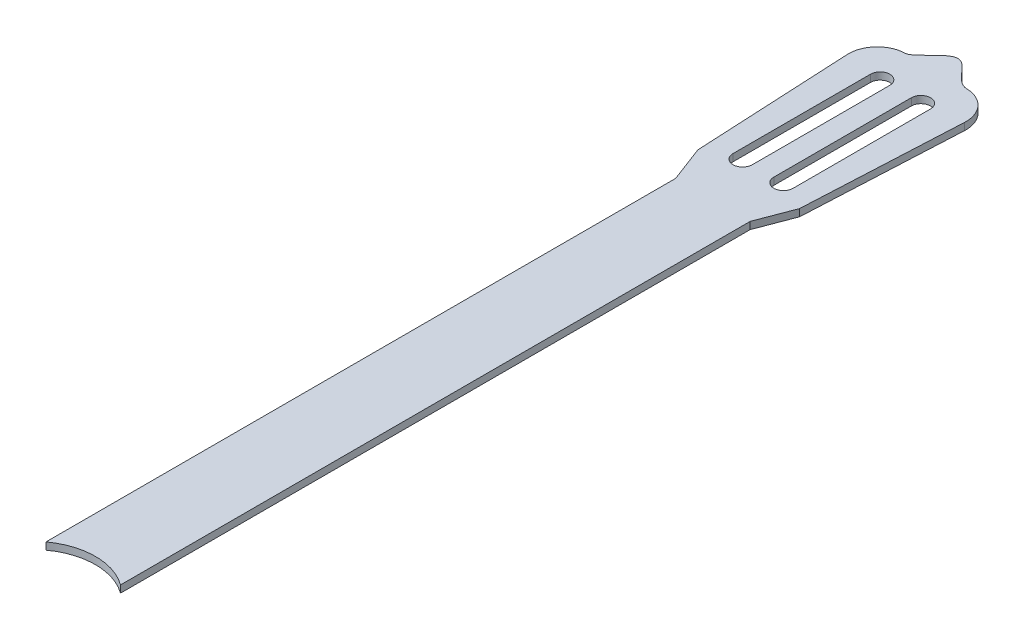
ISO-10303-21;
HEADER;
FILE_DESCRIPTION(('STEP AP214'),'2;1');
FILE_NAME('part.step','',(''),(''),'','','');
FILE_SCHEMA(('AUTOMOTIVE_DESIGN { 1 0 10303 214 1 1 1 1 }'));
ENDSEC;
DATA;
#1=APPLICATION_CONTEXT('core data for automotive mechanical design processes');
#2=APPLICATION_PROTOCOL_DEFINITION('international standard','automotive_design',2000,#1);
#3=PRODUCT_CONTEXT('',#1,'mechanical');
#4=PRODUCT('Part','Part','',(#3));
#5=PRODUCT_RELATED_PRODUCT_CATEGORY('part','',(#4));
#6=PRODUCT_DEFINITION_FORMATION('','',#4);
#7=PRODUCT_DEFINITION_CONTEXT('part definition',#1,'design');
#8=PRODUCT_DEFINITION('design','',#6,#7);
#9=PRODUCT_DEFINITION_SHAPE('','',#8);
#10=(LENGTH_UNIT() NAMED_UNIT(*) SI_UNIT(.MILLI.,.METRE.));
#11=(NAMED_UNIT(*) PLANE_ANGLE_UNIT() SI_UNIT($,.RADIAN.));
#12=(NAMED_UNIT(*) SI_UNIT($,.STERADIAN.) SOLID_ANGLE_UNIT());
#13=UNCERTAINTY_MEASURE_WITH_UNIT(LENGTH_MEASURE(1.E-05),#10,'distance_accuracy_value','');
#14=(GEOMETRIC_REPRESENTATION_CONTEXT(3) GLOBAL_UNCERTAINTY_ASSIGNED_CONTEXT((#13)) GLOBAL_UNIT_ASSIGNED_CONTEXT((#10,
#11,#12)) REPRESENTATION_CONTEXT('',''));
#15=CARTESIAN_POINT('',(0.,0.,0.));
#16=DIRECTION('',(0.,0.,1.));
#17=DIRECTION('',(1.,0.,0.));
#18=AXIS2_PLACEMENT_3D('',#15,#16,#17);
#19=CARTESIAN_POINT('',(0.,10.,-95.5));
#20=DIRECTION('',(0.,-1.,0.));
#21=DIRECTION('',(0.,0.,-1.));
#22=AXIS2_PLACEMENT_3D('',#19,#20,#21);
#23=CYLINDRICAL_SURFACE('',#22,44.);
#24=CARTESIAN_POINT('',(0.,5.,-95.5));
#25=DIRECTION('',(0.,-1.,0.));
#26=DIRECTION('',(0.,0.,1.));
#27=AXIS2_PLACEMENT_3D('',#24,#25,#26);
#28=CIRCLE('',#27,44.);
#29=CARTESIAN_POINT('',(-26.,5.,-130.996478698598));
#30=VERTEX_POINT('',#29);
#31=CARTESIAN_POINT('',(26.,5.,-130.996478698598));
#32=VERTEX_POINT('',#31);
#33=EDGE_CURVE('E283',#30,#32,#28,.T.);
#34=ORIENTED_EDGE('',*,*,#33,.T.);
#35=DIRECTION('',(0.,-1.,0.));
#36=VECTOR('',#35,1.);
#37=CARTESIAN_POINT('',(26.,10.,-130.996478698598));
#38=LINE('',#37,#36);
#39=CARTESIAN_POINT('',(26.,10.,-130.996478698598));
#40=VERTEX_POINT('',#39);
#41=EDGE_CURVE('E11',#40,#32,#38,.T.);
#42=ORIENTED_EDGE('',*,*,#41,.F.);
#43=CARTESIAN_POINT('',(0.,10.,-95.5));
#44=DIRECTION('',(0.,-1.,0.));
#45=DIRECTION('',(0.,0.,1.));
#46=AXIS2_PLACEMENT_3D('',#43,#44,#45);
#47=CIRCLE('',#46,44.);
#48=CARTESIAN_POINT('',(-26.,10.,-130.996478698598));
#49=VERTEX_POINT('',#48);
#50=EDGE_CURVE('E313',#49,#40,#47,.T.);
#51=ORIENTED_EDGE('',*,*,#50,.F.);
#52=DIRECTION('',(0.,-1.,0.));
#53=VECTOR('',#52,1.);
#54=CARTESIAN_POINT('',(-26.,10.,-130.996478698598));
#55=LINE('',#54,#53);
#56=EDGE_CURVE('E317',#49,#30,#55,.T.);
#57=ORIENTED_EDGE('',*,*,#56,.T.);
#58=EDGE_LOOP('',(#34,#42,#51,#57));
#59=FACE_BOUND('',#58,.T.);
#60=ADVANCED_FACE('F36',(#59),#23,.F.);
#61=CARTESIAN_POINT('',(26.,10.,-130.996478698598));
#62=DIRECTION('',(-1.,0.,0.));
#63=DIRECTION('',(0.,0.,1.));
#64=AXIS2_PLACEMENT_3D('',#61,#62,#63);
#65=PLANE('',#64);
#66=DIRECTION('',(0.,0.,-1.));
#67=VECTOR('',#66,1.);
#68=CARTESIAN_POINT('',(26.,5.,-130.996478698598));
#69=LINE('',#68,#67);
#70=CARTESIAN_POINT('',(26.,5.,-570.5));
#71=VERTEX_POINT('',#70);
#72=EDGE_CURVE('E320',#32,#71,#69,.T.);
#73=ORIENTED_EDGE('',*,*,#72,.T.);
#74=DIRECTION('',(0.,-1.,0.));
#75=VECTOR('',#74,1.);
#76=CARTESIAN_POINT('',(26.,10.,-570.5));
#77=LINE('',#76,#75);
#78=CARTESIAN_POINT('',(26.,10.,-570.5));
#79=VERTEX_POINT('',#78);
#80=EDGE_CURVE('E44',#79,#71,#77,.T.);
#81=ORIENTED_EDGE('',*,*,#80,.F.);
#82=DIRECTION('',(0.,0.,-1.));
#83=VECTOR('',#82,1.);
#84=CARTESIAN_POINT('',(26.,10.,-130.996478698598));
#85=LINE('',#84,#83);
#86=EDGE_CURVE('E76',#40,#79,#85,.T.);
#87=ORIENTED_EDGE('',*,*,#86,.F.);
#88=ORIENTED_EDGE('',*,*,#41,.T.);
#89=EDGE_LOOP('',(#73,#81,#87,#88));
#90=FACE_BOUND('',#89,.T.);
#91=ADVANCED_FACE('F345',(#90),#65,.F.);
#92=CARTESIAN_POINT('',(-26.,10.,-130.996478698598));
#93=DIRECTION('',(1.,0.,0.));
#94=DIRECTION('',(0.,0.,-1.));
#95=AXIS2_PLACEMENT_3D('',#92,#93,#94);
#96=PLANE('',#95);
#97=DIRECTION('',(0.,0.,1.));
#98=VECTOR('',#97,1.);
#99=CARTESIAN_POINT('',(-26.,5.,-130.996478698598));
#100=LINE('',#99,#98);
#101=CARTESIAN_POINT('',(-26.,5.,-570.5));
#102=VERTEX_POINT('',#101);
#103=EDGE_CURVE('E69',#102,#30,#100,.T.);
#104=ORIENTED_EDGE('',*,*,#103,.T.);
#105=ORIENTED_EDGE('',*,*,#56,.F.);
#106=DIRECTION('',(0.,0.,1.));
#107=VECTOR('',#106,1.);
#108=CARTESIAN_POINT('',(-26.,10.,-130.996478698598));
#109=LINE('',#108,#107);
#110=CARTESIAN_POINT('',(-26.,10.,-570.5));
#111=VERTEX_POINT('',#110);
#112=EDGE_CURVE('E52',#111,#49,#109,.T.);
#113=ORIENTED_EDGE('',*,*,#112,.F.);
#114=DIRECTION('',(0.,-1.,0.));
#115=VECTOR('',#114,1.);
#116=CARTESIAN_POINT('',(-26.,10.,-570.5));
#117=LINE('',#116,#115);
#118=EDGE_CURVE('E66',#111,#102,#117,.T.);
#119=ORIENTED_EDGE('',*,*,#118,.T.);
#120=EDGE_LOOP('',(#104,#105,#113,#119));
#121=FACE_BOUND('',#120,.T.);
#122=ADVANCED_FACE('F347',(#121),#96,.F.);
#123=CARTESIAN_POINT('',(0.,10.,-95.5));
#124=DIRECTION('',(0.,1.,0.));
#125=DIRECTION('',(0.,0.,1.));
#126=AXIS2_PLACEMENT_3D('',#123,#124,#125);
#127=PLANE('',#126);
#128=CARTESIAN_POINT('',(21.0250764201305,10.,-706.230163942517));
#129=DIRECTION('',(0.,1.,0.));
#130=DIRECTION('',(0.,0.,1.));
#131=AXIS2_PLACEMENT_3D('',#128,#129,#130);
#132=CIRCLE('',#131,20.);
#133=CARTESIAN_POINT('',(41.,10.,-705.228950689322));
#134=VERTEX_POINT('',#133);
#135=CARTESIAN_POINT('',(21.5383523088264,10.,-726.223576554227));
#136=VERTEX_POINT('',#135);
#137=EDGE_CURVE('E211',#134,#136,#132,.T.);
#138=ORIENTED_EDGE('',*,*,#137,.T.);
#139=CARTESIAN_POINT('',(21.5383523088265,10.,-726.223576554227));
#140=CARTESIAN_POINT('',(12.9027093627812,10.,-726.445272939615));
#141=CARTESIAN_POINT('',(1.57512347588201,10.,-756.595164024179));
#142=CARTESIAN_POINT('',(-16.0529563145449,10.,-726.364399012028));
#143=CARTESIAN_POINT('',(-21.5383523088262,10.,-726.223576554227));
#144=B_SPLINE_CURVE_WITH_KNOTS('',3,(#139,#140,#141,#142,#143),.UNSPECIFIED.,.F.,.F.,(4,1,4),
(0.,0.500000000000003,1.),.UNSPECIFIED.);
#145=CARTESIAN_POINT('',(-21.5383523088262,10.,-726.223576554227));
#146=VERTEX_POINT('',#145);
#147=EDGE_CURVE('E190',#136,#146,#144,.T.);
#148=ORIENTED_EDGE('',*,*,#147,.T.);
#149=CARTESIAN_POINT('',(-21.0250764201305,10.,-706.230163942517));
#150=DIRECTION('',(0.,1.,0.));
#151=DIRECTION('',(0.,0.,1.));
#152=AXIS2_PLACEMENT_3D('',#149,#150,#151);
#153=CIRCLE('',#152,20.);
#154=CARTESIAN_POINT('',(-41.,10.,-705.228950689322));
#155=VERTEX_POINT('',#154);
#156=EDGE_CURVE('E265',#146,#155,#153,.T.);
#157=ORIENTED_EDGE('',*,*,#156,.T.);
#158=DIRECTION('',(0.0500606626597283,0.,0.998746178993476));
#159=VECTOR('',#158,1.);
#160=CARTESIAN_POINT('',(-5.63728771732021,10.,0.28256063919764));
#161=LINE('',#160,#159);
#162=CARTESIAN_POINT('',(-35.5,10.,-595.5));
#163=VERTEX_POINT('',#162);
#164=EDGE_CURVE('E268',#155,#163,#161,.T.);
#165=ORIENTED_EDGE('',*,*,#164,.T.);
#166=DIRECTION('',(0.355217760623571,0.,0.93478358058835));
#167=VECTOR('',#166,1.);
#168=CARTESIAN_POINT('',(166.716183152743,10.,-63.3521495980419));
#169=LINE('',#168,#167);
#170=EDGE_CURVE('E271',#163,#111,#169,.T.);
#171=ORIENTED_EDGE('',*,*,#170,.T.);
#172=ORIENTED_EDGE('',*,*,#112,.T.);
#173=ORIENTED_EDGE('',*,*,#50,.T.);
#174=ORIENTED_EDGE('',*,*,#86,.T.);
#175=DIRECTION('',(0.355217760623571,0.,-0.93478358058835));
#176=VECTOR('',#175,1.);
#177=CARTESIAN_POINT('',(-166.716183152743,10.,-63.3521495980419));
#178=LINE('',#177,#176);
#179=CARTESIAN_POINT('',(35.5,10.,-595.5));
#180=VERTEX_POINT('',#179);
#181=EDGE_CURVE('E273',#79,#180,#178,.T.);
#182=ORIENTED_EDGE('',*,*,#181,.T.);
#183=DIRECTION('',(0.0500606626597283,0.,-0.998746178993476));
#184=VECTOR('',#183,1.);
#185=CARTESIAN_POINT('',(5.63728771732021,10.,0.28256063919764));
#186=LINE('',#185,#184);
#187=EDGE_CURVE('E276',#180,#134,#186,.T.);
#188=ORIENTED_EDGE('',*,*,#187,.T.);
#189=EDGE_LOOP('',(#138,#148,#157,#165,#171,#172,#173,#174,#182,#188));
#190=FACE_BOUND('',#189,.T.);
#191=CARTESIAN_POINT('',(14.2412020799844,10.,-605.499999999999));
#192=DIRECTION('',(0.,1.,0.));
#193=DIRECTION('',(0.,0.,1.));
#194=AXIS2_PLACEMENT_3D('',#191,#192,#193);
#195=CIRCLE('',#194,6.74120207998441);
#196=CARTESIAN_POINT('',(7.5,10.,-605.499999999999));
#197=VERTEX_POINT('',#196);
#198=CARTESIAN_POINT('',(20.9824041599688,10.,-605.499999999999));
#199=VERTEX_POINT('',#198);
#200=EDGE_CURVE('E207',#197,#199,#195,.T.);
#201=ORIENTED_EDGE('',*,*,#200,.F.);
#202=DIRECTION('',(0.,0.,1.));
#203=VECTOR('',#202,1.);
#204=CARTESIAN_POINT('',(7.49999999999999,10.,0.));
#205=LINE('',#204,#203);
#206=CARTESIAN_POINT('',(7.5,10.,-701.465458299911));
#207=VERTEX_POINT('',#206);
#208=EDGE_CURVE('E248',#207,#197,#205,.T.);
#209=ORIENTED_EDGE('',*,*,#208,.F.);
#210=CARTESIAN_POINT('',(14.2412020799844,10.,-701.465458299911));
#211=DIRECTION('',(0.,1.,0.));
#212=DIRECTION('',(0.,0.,1.));
#213=AXIS2_PLACEMENT_3D('',#210,#211,#212);
#214=CIRCLE('',#213,6.74120207998441);
#215=CARTESIAN_POINT('',(20.9824041599688,10.,-701.465458299911));
#216=VERTEX_POINT('',#215);
#217=EDGE_CURVE('E250',#216,#207,#214,.T.);
#218=ORIENTED_EDGE('',*,*,#217,.F.);
#219=DIRECTION('',(0.,0.,1.));
#220=VECTOR('',#219,1.);
#221=CARTESIAN_POINT('',(20.9824041599689,10.,0.));
#222=LINE('',#221,#220);
#223=EDGE_CURVE('E252',#216,#199,#222,.T.);
#224=ORIENTED_EDGE('',*,*,#223,.T.);
#225=EDGE_LOOP('',(#201,#209,#218,#224));
#226=FACE_BOUND('',#225,.T.);
#227=CARTESIAN_POINT('',(-14.2412020799844,10.,-605.499999999999));
#228=DIRECTION('',(0.,1.,0.));
#229=DIRECTION('',(0.,0.,1.));
#230=AXIS2_PLACEMENT_3D('',#227,#228,#229);
#231=CIRCLE('',#230,6.74120207998443);
#232=CARTESIAN_POINT('',(-20.9824041599688,10.,-605.499999999999));
#233=VERTEX_POINT('',#232);
#234=CARTESIAN_POINT('',(-7.49999999999997,10.,-605.499999999999));
#235=VERTEX_POINT('',#234);
#236=EDGE_CURVE('E255',#233,#235,#231,.T.);
#237=ORIENTED_EDGE('',*,*,#236,.F.);
#238=DIRECTION('',(0.,0.,1.));
#239=VECTOR('',#238,1.);
#240=CARTESIAN_POINT('',(-20.9824041599689,10.,0.));
#241=LINE('',#240,#239);
#242=CARTESIAN_POINT('',(-20.9824041599688,10.,-701.465458299911));
#243=VERTEX_POINT('',#242);
#244=EDGE_CURVE('E258',#243,#233,#241,.T.);
#245=ORIENTED_EDGE('',*,*,#244,.F.);
#246=CARTESIAN_POINT('',(-14.2412020799844,10.,-701.465458299911));
#247=DIRECTION('',(0.,1.,0.));
#248=DIRECTION('',(0.,0.,1.));
#249=AXIS2_PLACEMENT_3D('',#246,#247,#248);
#250=CIRCLE('',#249,6.74120207998441);
#251=CARTESIAN_POINT('',(-7.5,10.,-701.465458299911));
#252=VERTEX_POINT('',#251);
#253=EDGE_CURVE('E260',#252,#243,#250,.T.);
#254=ORIENTED_EDGE('',*,*,#253,.F.);
#255=DIRECTION('',(0.,0.,1.));
#256=VECTOR('',#255,1.);
#257=CARTESIAN_POINT('',(-7.49999999999982,10.,0.));
#258=LINE('',#257,#256);
#259=EDGE_CURVE('E262',#252,#235,#258,.T.);
#260=ORIENTED_EDGE('',*,*,#259,.T.);
#261=EDGE_LOOP('',(#237,#245,#254,#260));
#262=FACE_BOUND('',#261,.T.);
#263=ADVANCED_FACE('F340',(#190,#226,#262),#127,.T.);
#264=CARTESIAN_POINT('',(0.,5.,-95.5));
#265=DIRECTION('',(0.,1.,0.));
#266=DIRECTION('',(0.,0.,1.));
#267=AXIS2_PLACEMENT_3D('',#264,#265,#266);
#268=PLANE('',#267);
#269=CARTESIAN_POINT('',(-21.0250764201305,5.,-706.230163942517));
#270=DIRECTION('',(0.,1.,0.));
#271=DIRECTION('',(0.,0.,1.));
#272=AXIS2_PLACEMENT_3D('',#269,#270,#271);
#273=CIRCLE('',#272,20.);
#274=CARTESIAN_POINT('',(-21.5383523088262,5.,-726.223576554227));
#275=VERTEX_POINT('',#274);
#276=CARTESIAN_POINT('',(-41.,5.,-705.228950689322));
#277=VERTEX_POINT('',#276);
#278=EDGE_CURVE('E227',#275,#277,#273,.T.);
#279=ORIENTED_EDGE('',*,*,#278,.F.);
#280=DIRECTION('',(1.,0.,0.));
#281=VECTOR('',#280,1.);
#282=CARTESIAN_POINT('',(0.,5.,-726.223576554227));
#283=LINE('',#282,#281);
#284=CARTESIAN_POINT('',(21.5383523088264,5.,-726.223576554227));
#285=VERTEX_POINT('',#284);
#286=EDGE_CURVE('E179',#275,#285,#283,.T.);
#287=ORIENTED_EDGE('',*,*,#286,.T.);
#288=CARTESIAN_POINT('',(21.0250764201305,5.,-706.230163942517));
#289=DIRECTION('',(0.,1.,0.));
#290=DIRECTION('',(0.,0.,1.));
#291=AXIS2_PLACEMENT_3D('',#288,#289,#290);
#292=CIRCLE('',#291,20.);
#293=CARTESIAN_POINT('',(41.,5.,-705.228950689322));
#294=VERTEX_POINT('',#293);
#295=EDGE_CURVE('E242',#294,#285,#292,.T.);
#296=ORIENTED_EDGE('',*,*,#295,.F.);
#297=DIRECTION('',(0.0500606626597283,0.,-0.998746178993476));
#298=VECTOR('',#297,1.);
#299=CARTESIAN_POINT('',(5.63728771732021,5.,0.28256063919764));
#300=LINE('',#299,#298);
#301=CARTESIAN_POINT('',(35.5,5.,-595.5));
#302=VERTEX_POINT('',#301);
#303=EDGE_CURVE('E239',#302,#294,#300,.T.);
#304=ORIENTED_EDGE('',*,*,#303,.F.);
#305=DIRECTION('',(0.355217760623571,0.,-0.93478358058835));
#306=VECTOR('',#305,1.);
#307=CARTESIAN_POINT('',(-166.716183152743,5.,-63.3521495980419));
#308=LINE('',#307,#306);
#309=EDGE_CURVE('E236',#71,#302,#308,.T.);
#310=ORIENTED_EDGE('',*,*,#309,.F.);
#311=ORIENTED_EDGE('',*,*,#72,.F.);
#312=ORIENTED_EDGE('',*,*,#33,.F.);
#313=ORIENTED_EDGE('',*,*,#103,.F.);
#314=DIRECTION('',(0.355217760623571,0.,0.93478358058835));
#315=VECTOR('',#314,1.);
#316=CARTESIAN_POINT('',(166.716183152743,5.,-63.3521495980419));
#317=LINE('',#316,#315);
#318=CARTESIAN_POINT('',(-35.5,5.,-595.5));
#319=VERTEX_POINT('',#318);
#320=EDGE_CURVE('E233',#319,#102,#317,.T.);
#321=ORIENTED_EDGE('',*,*,#320,.F.);
#322=DIRECTION('',(0.0500606626597283,0.,0.998746178993476));
#323=VECTOR('',#322,1.);
#324=CARTESIAN_POINT('',(-5.63728771732021,5.,0.28256063919764));
#325=LINE('',#324,#323);
#326=EDGE_CURVE('E230',#277,#319,#325,.T.);
#327=ORIENTED_EDGE('',*,*,#326,.F.);
#328=EDGE_LOOP('',(#279,#287,#296,#304,#310,#311,#312,#313,#321,#327));
#329=FACE_BOUND('',#328,.T.);
#330=CARTESIAN_POINT('',(14.2412020799844,5.,-605.499999999999));
#331=DIRECTION('',(0.,1.,0.));
#332=DIRECTION('',(0.,0.,1.));
#333=AXIS2_PLACEMENT_3D('',#330,#331,#332);
#334=CIRCLE('',#333,6.74120207998441);
#335=CARTESIAN_POINT('',(7.5,5.,-605.499999999999));
#336=VERTEX_POINT('',#335);
#337=CARTESIAN_POINT('',(20.9824041599688,5.,-605.499999999999));
#338=VERTEX_POINT('',#337);
#339=EDGE_CURVE('E208',#336,#338,#334,.T.);
#340=ORIENTED_EDGE('',*,*,#339,.T.);
#341=DIRECTION('',(0.,0.,1.));
#342=VECTOR('',#341,1.);
#343=CARTESIAN_POINT('',(20.9824041599689,5.,0.));
#344=LINE('',#343,#342);
#345=CARTESIAN_POINT('',(20.9824041599688,5.,-701.465458299911));
#346=VERTEX_POINT('',#345);
#347=EDGE_CURVE('E215',#346,#338,#344,.T.);
#348=ORIENTED_EDGE('',*,*,#347,.F.);
#349=CARTESIAN_POINT('',(14.2412020799844,5.,-701.465458299911));
#350=DIRECTION('',(0.,1.,0.));
#351=DIRECTION('',(0.,0.,1.));
#352=AXIS2_PLACEMENT_3D('',#349,#350,#351);
#353=CIRCLE('',#352,6.74120207998441);
#354=CARTESIAN_POINT('',(7.5,5.,-701.465458299911));
#355=VERTEX_POINT('',#354);
#356=EDGE_CURVE('E213',#346,#355,#353,.T.);
#357=ORIENTED_EDGE('',*,*,#356,.T.);
#358=DIRECTION('',(0.,0.,1.));
#359=VECTOR('',#358,1.);
#360=CARTESIAN_POINT('',(7.49999999999999,5.,0.));
#361=LINE('',#360,#359);
#362=EDGE_CURVE('E210',#355,#336,#361,.T.);
#363=ORIENTED_EDGE('',*,*,#362,.T.);
#364=EDGE_LOOP('',(#340,#348,#357,#363));
#365=FACE_BOUND('',#364,.T.);
#366=CARTESIAN_POINT('',(-14.2412020799844,5.,-605.499999999999));
#367=DIRECTION('',(0.,1.,0.));
#368=DIRECTION('',(0.,0.,1.));
#369=AXIS2_PLACEMENT_3D('',#366,#367,#368);
#370=CIRCLE('',#369,6.74120207998443);
#371=CARTESIAN_POINT('',(-20.9824041599688,5.,-605.499999999999));
#372=VERTEX_POINT('',#371);
#373=CARTESIAN_POINT('',(-7.49999999999997,5.,-605.499999999999));
#374=VERTEX_POINT('',#373);
#375=EDGE_CURVE('E218',#372,#374,#370,.T.);
#376=ORIENTED_EDGE('',*,*,#375,.T.);
#377=DIRECTION('',(0.,0.,1.));
#378=VECTOR('',#377,1.);
#379=CARTESIAN_POINT('',(-7.49999999999982,5.,0.));
#380=LINE('',#379,#378);
#381=CARTESIAN_POINT('',(-7.5,5.,-701.465458299911));
#382=VERTEX_POINT('',#381);
#383=EDGE_CURVE('E224',#382,#374,#380,.T.);
#384=ORIENTED_EDGE('',*,*,#383,.F.);
#385=CARTESIAN_POINT('',(-14.2412020799844,5.,-701.465458299911));
#386=DIRECTION('',(0.,1.,0.));
#387=DIRECTION('',(0.,0.,1.));
#388=AXIS2_PLACEMENT_3D('',#385,#386,#387);
#389=CIRCLE('',#388,6.74120207998441);
#390=CARTESIAN_POINT('',(-20.9824041599688,5.,-701.465458299911));
#391=VERTEX_POINT('',#390);
#392=EDGE_CURVE('E222',#382,#391,#389,.T.);
#393=ORIENTED_EDGE('',*,*,#392,.T.);
#394=DIRECTION('',(0.,0.,1.));
#395=VECTOR('',#394,1.);
#396=CARTESIAN_POINT('',(-20.9824041599689,5.,0.));
#397=LINE('',#396,#395);
#398=EDGE_CURVE('E220',#391,#372,#397,.T.);
#399=ORIENTED_EDGE('',*,*,#398,.T.);
#400=EDGE_LOOP('',(#376,#384,#393,#399));
#401=FACE_BOUND('',#400,.T.);
#402=ADVANCED_FACE('F332',(#329,#365,#401),#268,.F.);
#403=CARTESIAN_POINT('',(21.0250764201305,5.,-706.230163942517));
#404=DIRECTION('',(0.,1.,0.));
#405=DIRECTION('',(0.,0.,1.));
#406=AXIS2_PLACEMENT_3D('',#403,#404,#405);
#407=CYLINDRICAL_SURFACE('',#406,20.);
#408=ORIENTED_EDGE('',*,*,#137,.F.);
#409=DIRECTION('',(0.,1.,0.));
#410=VECTOR('',#409,1.);
#411=CARTESIAN_POINT('',(41.,5.,-705.228950689322));
#412=LINE('',#411,#410);
#413=EDGE_CURVE('E284',#294,#134,#412,.T.);
#414=ORIENTED_EDGE('',*,*,#413,.F.);
#415=ORIENTED_EDGE('',*,*,#295,.T.);
#416=DIRECTION('',(0.,1.,0.));
#417=VECTOR('',#416,1.);
#418=CARTESIAN_POINT('',(21.5383523088264,5.,-726.223576554227));
#419=LINE('',#418,#417);
#420=EDGE_CURVE('E281',#285,#136,#419,.T.);
#421=ORIENTED_EDGE('',*,*,#420,.T.);
#422=EDGE_LOOP('',(#408,#414,#415,#421));
#423=FACE_BOUND('',#422,.T.);
#424=ADVANCED_FACE('F356',(#423),#407,.T.);
#425=CARTESIAN_POINT('',(5.63728771732021,5.,0.28256063919764));
#426=DIRECTION('',(0.998746178993476,0.,0.0500606626597283));
#427=DIRECTION('',(0.0500606626597283,0.,-0.998746178993476));
#428=AXIS2_PLACEMENT_3D('',#425,#426,#427);
#429=PLANE('',#428);
#430=ORIENTED_EDGE('',*,*,#187,.F.);
#431=DIRECTION('',(0.,1.,0.));
#432=VECTOR('',#431,1.);
#433=CARTESIAN_POINT('',(35.5,5.,-595.5));
#434=LINE('',#433,#432);
#435=EDGE_CURVE('E286',#302,#180,#434,.T.);
#436=ORIENTED_EDGE('',*,*,#435,.F.);
#437=ORIENTED_EDGE('',*,*,#303,.T.);
#438=ORIENTED_EDGE('',*,*,#413,.T.);
#439=EDGE_LOOP('',(#430,#436,#437,#438));
#440=FACE_BOUND('',#439,.T.);
#441=ADVANCED_FACE('F338',(#440),#429,.T.);
#442=CARTESIAN_POINT('',(-166.716183152743,5.,-63.3521495980419));
#443=DIRECTION('',(0.93478358058835,0.,0.355217760623571));
#444=DIRECTION('',(0.355217760623571,0.,-0.93478358058835));
#445=AXIS2_PLACEMENT_3D('',#442,#443,#444);
#446=PLANE('',#445);
#447=ORIENTED_EDGE('',*,*,#181,.F.);
#448=ORIENTED_EDGE('',*,*,#80,.T.);
#449=ORIENTED_EDGE('',*,*,#309,.T.);
#450=ORIENTED_EDGE('',*,*,#435,.T.);
#451=EDGE_LOOP('',(#447,#448,#449,#450));
#452=FACE_BOUND('',#451,.T.);
#453=ADVANCED_FACE('F328',(#452),#446,.T.);
#454=CARTESIAN_POINT('',(166.716183152743,5.,-63.3521495980419));
#455=DIRECTION('',(-0.93478358058835,0.,0.355217760623571));
#456=DIRECTION('',(0.355217760623571,0.,0.93478358058835));
#457=AXIS2_PLACEMENT_3D('',#454,#455,#456);
#458=PLANE('',#457);
#459=ORIENTED_EDGE('',*,*,#170,.F.);
#460=DIRECTION('',(0.,1.,0.));
#461=VECTOR('',#460,1.);
#462=CARTESIAN_POINT('',(-35.5,5.,-595.5));
#463=LINE('',#462,#461);
#464=EDGE_CURVE('E288',#319,#163,#463,.T.);
#465=ORIENTED_EDGE('',*,*,#464,.F.);
#466=ORIENTED_EDGE('',*,*,#320,.T.);
#467=ORIENTED_EDGE('',*,*,#118,.F.);
#468=EDGE_LOOP('',(#459,#465,#466,#467));
#469=FACE_BOUND('',#468,.T.);
#470=ADVANCED_FACE('F398',(#469),#458,.T.);
#471=CARTESIAN_POINT('',(-5.63728771732021,5.,0.28256063919764));
#472=DIRECTION('',(-0.998746178993476,0.,0.0500606626597283));
#473=DIRECTION('',(0.0500606626597283,0.,0.998746178993476));
#474=AXIS2_PLACEMENT_3D('',#471,#472,#473);
#475=PLANE('',#474);
#476=ORIENTED_EDGE('',*,*,#164,.F.);
#477=DIRECTION('',(0.,1.,0.));
#478=VECTOR('',#477,1.);
#479=CARTESIAN_POINT('',(-41.,5.,-705.228950689322));
#480=LINE('',#479,#478);
#481=EDGE_CURVE('E290',#277,#155,#480,.T.);
#482=ORIENTED_EDGE('',*,*,#481,.F.);
#483=ORIENTED_EDGE('',*,*,#326,.T.);
#484=ORIENTED_EDGE('',*,*,#464,.T.);
#485=EDGE_LOOP('',(#476,#482,#483,#484));
#486=FACE_BOUND('',#485,.T.);
#487=ADVANCED_FACE('F382',(#486),#475,.T.);
#488=CARTESIAN_POINT('',(-14.2412020799844,5.,-605.499999999999));
#489=DIRECTION('',(0.,1.,0.));
#490=DIRECTION('',(0.,0.,1.));
#491=AXIS2_PLACEMENT_3D('',#488,#489,#490);
#492=CYLINDRICAL_SURFACE('',#491,6.74120207998443);
#493=ORIENTED_EDGE('',*,*,#236,.T.);
#494=DIRECTION('',(0.,1.,0.));
#495=VECTOR('',#494,1.);
#496=CARTESIAN_POINT('',(-7.49999999999997,5.,-605.499999999999));
#497=LINE('',#496,#495);
#498=EDGE_CURVE('E294',#374,#235,#497,.T.);
#499=ORIENTED_EDGE('',*,*,#498,.F.);
#500=ORIENTED_EDGE('',*,*,#375,.F.);
#501=DIRECTION('',(0.,1.,0.));
#502=VECTOR('',#501,1.);
#503=CARTESIAN_POINT('',(-20.9824041599688,5.,-605.499999999999));
#504=LINE('',#503,#502);
#505=EDGE_CURVE('E301',#372,#233,#504,.T.);
#506=ORIENTED_EDGE('',*,*,#505,.T.);
#507=EDGE_LOOP('',(#493,#499,#500,#506));
#508=FACE_BOUND('',#507,.T.);
#509=ADVANCED_FACE('F378',(#508),#492,.F.);
#510=CARTESIAN_POINT('',(-7.49999999999982,5.,0.));
#511=DIRECTION('',(-1.,0.,0.));
#512=DIRECTION('',(0.,0.,1.));
#513=AXIS2_PLACEMENT_3D('',#510,#511,#512);
#514=PLANE('',#513);
#515=ORIENTED_EDGE('',*,*,#259,.F.);
#516=DIRECTION('',(0.,1.,0.));
#517=VECTOR('',#516,1.);
#518=CARTESIAN_POINT('',(-7.5,5.,-701.465458299911));
#519=LINE('',#518,#517);
#520=EDGE_CURVE('E296',#382,#252,#519,.T.);
#521=ORIENTED_EDGE('',*,*,#520,.F.);
#522=ORIENTED_EDGE('',*,*,#383,.T.);
#523=ORIENTED_EDGE('',*,*,#498,.T.);
#524=EDGE_LOOP('',(#515,#521,#522,#523));
#525=FACE_BOUND('',#524,.T.);
#526=ADVANCED_FACE('F381',(#525),#514,.T.);
#527=CARTESIAN_POINT('',(-14.2412020799844,5.,-701.465458299911));
#528=DIRECTION('',(0.,1.,0.));
#529=DIRECTION('',(0.,0.,1.));
#530=AXIS2_PLACEMENT_3D('',#527,#528,#529);
#531=CYLINDRICAL_SURFACE('',#530,6.74120207998441);
#532=ORIENTED_EDGE('',*,*,#253,.T.);
#533=DIRECTION('',(0.,1.,0.));
#534=VECTOR('',#533,1.);
#535=CARTESIAN_POINT('',(-20.9824041599688,5.,-701.465458299911));
#536=LINE('',#535,#534);
#537=EDGE_CURVE('E298',#391,#243,#536,.T.);
#538=ORIENTED_EDGE('',*,*,#537,.F.);
#539=ORIENTED_EDGE('',*,*,#392,.F.);
#540=ORIENTED_EDGE('',*,*,#520,.T.);
#541=EDGE_LOOP('',(#532,#538,#539,#540));
#542=FACE_BOUND('',#541,.T.);
#543=ADVANCED_FACE('F363',(#542),#531,.F.);
#544=CARTESIAN_POINT('',(14.2412020799844,5.,-605.499999999999));
#545=DIRECTION('',(0.,1.,0.));
#546=DIRECTION('',(0.,0.,1.));
#547=AXIS2_PLACEMENT_3D('',#544,#545,#546);
#548=CYLINDRICAL_SURFACE('',#547,6.74120207998441);
#549=ORIENTED_EDGE('',*,*,#200,.T.);
#550=DIRECTION('',(0.,1.,0.));
#551=VECTOR('',#550,1.);
#552=CARTESIAN_POINT('',(20.9824041599688,5.,-605.499999999999));
#553=LINE('',#552,#551);
#554=EDGE_CURVE('E304',#338,#199,#553,.T.);
#555=ORIENTED_EDGE('',*,*,#554,.F.);
#556=ORIENTED_EDGE('',*,*,#339,.F.);
#557=DIRECTION('',(0.,1.,0.));
#558=VECTOR('',#557,1.);
#559=CARTESIAN_POINT('',(7.5,5.,-605.499999999999));
#560=LINE('',#559,#558);
#561=EDGE_CURVE('E245',#336,#197,#560,.T.);
#562=ORIENTED_EDGE('',*,*,#561,.T.);
#563=EDGE_LOOP('',(#549,#555,#556,#562));
#564=FACE_BOUND('',#563,.T.);
#565=ADVANCED_FACE('F359',(#564),#548,.F.);
#566=CARTESIAN_POINT('',(20.9824041599689,5.,0.));
#567=DIRECTION('',(-1.,0.,0.));
#568=DIRECTION('',(0.,0.,1.));
#569=AXIS2_PLACEMENT_3D('',#566,#567,#568);
#570=PLANE('',#569);
#571=ORIENTED_EDGE('',*,*,#223,.F.);
#572=DIRECTION('',(0.,1.,0.));
#573=VECTOR('',#572,1.);
#574=CARTESIAN_POINT('',(20.9824041599688,5.,-701.465458299911));
#575=LINE('',#574,#573);
#576=EDGE_CURVE('E306',#346,#216,#575,.T.);
#577=ORIENTED_EDGE('',*,*,#576,.F.);
#578=ORIENTED_EDGE('',*,*,#347,.T.);
#579=ORIENTED_EDGE('',*,*,#554,.T.);
#580=EDGE_LOOP('',(#571,#577,#578,#579));
#581=FACE_BOUND('',#580,.T.);
#582=ADVANCED_FACE('F362',(#581),#570,.T.);
#583=CARTESIAN_POINT('',(14.2412020799844,5.,-701.465458299911));
#584=DIRECTION('',(0.,1.,0.));
#585=DIRECTION('',(0.,0.,1.));
#586=AXIS2_PLACEMENT_3D('',#583,#584,#585);
#587=CYLINDRICAL_SURFACE('',#586,6.74120207998441);
#588=ORIENTED_EDGE('',*,*,#217,.T.);
#589=DIRECTION('',(0.,1.,0.));
#590=VECTOR('',#589,1.);
#591=CARTESIAN_POINT('',(7.5,5.,-701.465458299911));
#592=LINE('',#591,#590);
#593=EDGE_CURVE('E308',#355,#207,#592,.T.);
#594=ORIENTED_EDGE('',*,*,#593,.F.);
#595=ORIENTED_EDGE('',*,*,#356,.F.);
#596=ORIENTED_EDGE('',*,*,#576,.T.);
#597=EDGE_LOOP('',(#588,#594,#595,#596));
#598=FACE_BOUND('',#597,.T.);
#599=ADVANCED_FACE('F371',(#598),#587,.F.);
#600=CARTESIAN_POINT('',(-20.9824041599689,5.,0.));
#601=DIRECTION('',(-1.,0.,0.));
#602=DIRECTION('',(0.,0.,1.));
#603=AXIS2_PLACEMENT_3D('',#600,#601,#602);
#604=PLANE('',#603);
#605=ORIENTED_EDGE('',*,*,#244,.T.);
#606=ORIENTED_EDGE('',*,*,#505,.F.);
#607=ORIENTED_EDGE('',*,*,#398,.F.);
#608=ORIENTED_EDGE('',*,*,#537,.T.);
#609=EDGE_LOOP('',(#605,#606,#607,#608));
#610=FACE_BOUND('',#609,.T.);
#611=ADVANCED_FACE('F369',(#610),#604,.F.);
#612=CARTESIAN_POINT('',(7.49999999999999,5.,0.));
#613=DIRECTION('',(-1.,0.,0.));
#614=DIRECTION('',(0.,0.,1.));
#615=AXIS2_PLACEMENT_3D('',#612,#613,#614);
#616=PLANE('',#615);
#617=ORIENTED_EDGE('',*,*,#208,.T.);
#618=ORIENTED_EDGE('',*,*,#561,.F.);
#619=ORIENTED_EDGE('',*,*,#362,.F.);
#620=ORIENTED_EDGE('',*,*,#593,.T.);
#621=EDGE_LOOP('',(#617,#618,#619,#620));
#622=FACE_BOUND('',#621,.T.);
#623=ADVANCED_FACE('F365',(#622),#616,.F.);
#624=CARTESIAN_POINT('',(-21.0250764201305,5.,-706.230163942517));
#625=DIRECTION('',(0.,1.,0.));
#626=DIRECTION('',(0.,0.,1.));
#627=AXIS2_PLACEMENT_3D('',#624,#625,#626);
#628=CYLINDRICAL_SURFACE('',#627,20.);
#629=ORIENTED_EDGE('',*,*,#156,.F.);
#630=DIRECTION('',(0.,1.,0.));
#631=VECTOR('',#630,1.);
#632=CARTESIAN_POINT('',(-21.5383523088262,5.,-726.223576554227));
#633=LINE('',#632,#631);
#634=EDGE_CURVE('E292',#275,#146,#633,.T.);
#635=ORIENTED_EDGE('',*,*,#634,.F.);
#636=ORIENTED_EDGE('',*,*,#278,.T.);
#637=ORIENTED_EDGE('',*,*,#481,.T.);
#638=EDGE_LOOP('',(#629,#635,#636,#637));
#639=FACE_BOUND('',#638,.T.);
#640=ADVANCED_FACE('F368',(#639),#628,.T.);
#641=CARTESIAN_POINT('',(-21.5383523088262,1.,-726.223576554227));
#642=DIRECTION('',(0.,0.,1.));
#643=DIRECTION('',(1.,0.,0.));
#644=AXIS2_PLACEMENT_3D('',#641,#642,#643);
#645=PLANE('',#644);
#646=ORIENTED_EDGE('',*,*,#286,.F.);
#647=DIRECTION('',(0.,1.,0.));
#648=VECTOR('',#647,1.);
#649=CARTESIAN_POINT('',(-21.5383523088262,1.,-726.223576554227));
#650=LINE('',#649,#648);
#651=CARTESIAN_POINT('',(-21.5383523088262,1.,-726.223576554227));
#652=VERTEX_POINT('',#651);
#653=EDGE_CURVE('E173',#652,#275,#650,.T.);
#654=ORIENTED_EDGE('',*,*,#653,.F.);
#655=DIRECTION('',(1.,0.,0.));
#656=VECTOR('',#655,1.);
#657=CARTESIAN_POINT('',(-21.5383523088262,1.,-726.223576554227));
#658=LINE('',#657,#656);
#659=CARTESIAN_POINT('',(21.5383523088264,1.,-726.223576554227));
#660=VERTEX_POINT('',#659);
#661=EDGE_CURVE('E178',#652,#660,#658,.T.);
#662=ORIENTED_EDGE('',*,*,#661,.T.);
#663=DIRECTION('',(0.,1.,0.));
#664=VECTOR('',#663,1.);
#665=CARTESIAN_POINT('',(21.5383523088264,1.,-726.223576554227));
#666=LINE('',#665,#664);
#667=EDGE_CURVE('E182',#660,#285,#666,.T.);
#668=ORIENTED_EDGE('',*,*,#667,.T.);
#669=EDGE_LOOP('',(#646,#654,#662,#668));
#670=FACE_BOUND('',#669,.T.);
#671=ADVANCED_FACE('F175',(#670),#645,.T.);
#672=CARTESIAN_POINT('',(21.5383523088265,1.,-726.223576554227));
#673=CARTESIAN_POINT('',(12.9027093627812,1.,-726.445272939615));
#674=CARTESIAN_POINT('',(1.57512347588201,1.,-756.595164024179));
#675=CARTESIAN_POINT('',(-16.0529563145449,1.,-726.364399012028));
#676=CARTESIAN_POINT('',(-21.5383523088262,1.,-726.223576554227));
#677=B_SPLINE_CURVE_WITH_KNOTS('',3,(#672,#673,#674,#675,#676),.UNSPECIFIED.,.F.,.F.,(4,1,4),
(0.,0.500000000000003,1.),.UNSPECIFIED.);
#678=DIRECTION('',(0.,1.,0.));
#679=VECTOR('',#678,1.);
#680=SURFACE_OF_LINEAR_EXTRUSION('',#677,#679);
#681=ORIENTED_EDGE('',*,*,#147,.F.);
#682=ORIENTED_EDGE('',*,*,#420,.F.);
#683=ORIENTED_EDGE('',*,*,#667,.F.);
#684=EDGE_CURVE('E185',#660,#652,#677,.T.);
#685=ORIENTED_EDGE('',*,*,#684,.T.);
#686=ORIENTED_EDGE('',*,*,#653,.T.);
#687=ORIENTED_EDGE('',*,*,#634,.T.);
#688=EDGE_LOOP('',(#681,#682,#683,#685,#686,#687));
#689=FACE_BOUND('',#688,.T.);
#690=ADVANCED_FACE('F187',(#689),#680,.T.);
#691=CARTESIAN_POINT('',(1.16945572222368E-13,1.,-741.5));
#692=DIRECTION('',(0.,-1.,0.));
#693=DIRECTION('',(0.,0.,-1.));
#694=AXIS2_PLACEMENT_3D('',#691,#692,#693);
#695=PLANE('',#694);
#696=ORIENTED_EDGE('',*,*,#684,.F.);
#697=ORIENTED_EDGE('',*,*,#661,.F.);
#698=EDGE_LOOP('',(#696,#697));
#699=FACE_BOUND('',#698,.T.);
#700=ADVANCED_FACE('F192',(#699),#695,.T.);
#701=CLOSED_SHELL('',(#60,#91,#122,#263,#402,#424,#441,#453,#470,#487,#509,#526,#543,#565,#582,
#599,#611,#623,#640,#671,#690,#700));
#702=MANIFOLD_SOLID_BREP('B2',#701);
#703=ADVANCED_BREP_SHAPE_REPRESENTATION('',(#18,#702),#14);
#704=SHAPE_DEFINITION_REPRESENTATION(#9,#703);
ENDSEC;
END-ISO-10303-21;
